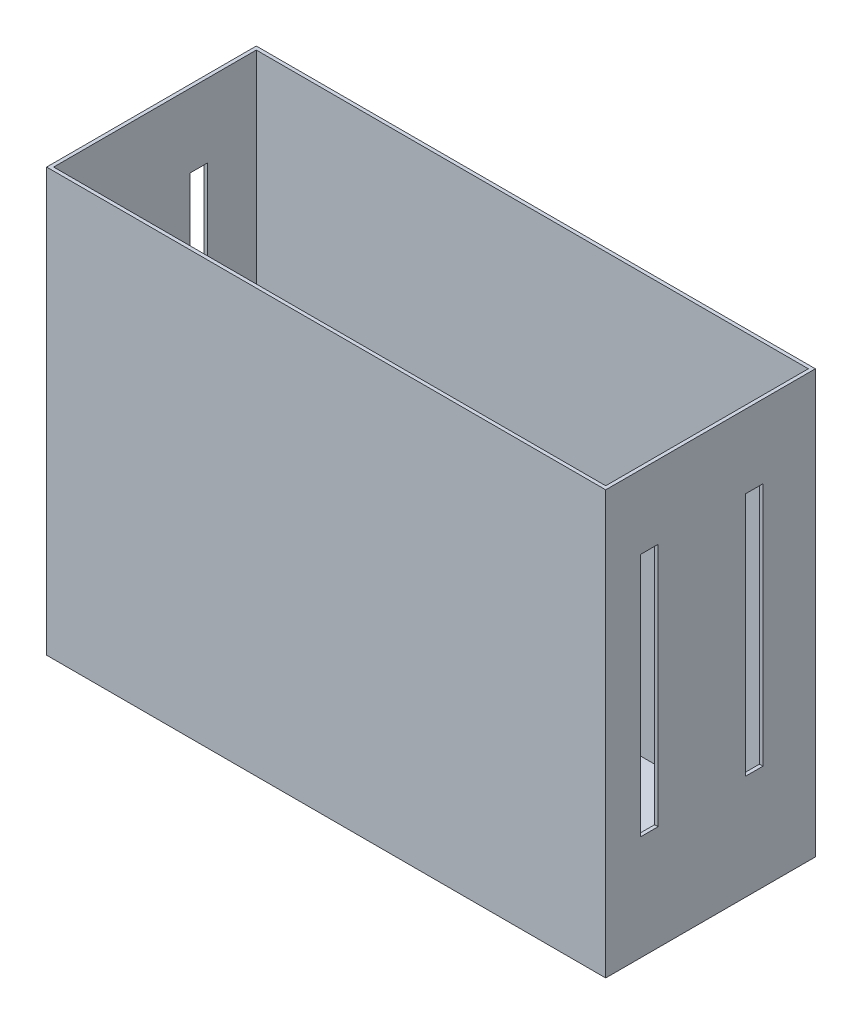
ISO-10303-21;
HEADER;
FILE_DESCRIPTION(('STEP AP214'),'2;1');
FILE_NAME('part.step','',(''),(''),'','','');
FILE_SCHEMA(('AUTOMOTIVE_DESIGN { 1 0 10303 214 1 1 1 1 }'));
ENDSEC;
DATA;
#1=APPLICATION_CONTEXT('core data for automotive mechanical design processes');
#2=APPLICATION_PROTOCOL_DEFINITION('international standard','automotive_design',2000,#1);
#3=PRODUCT_CONTEXT('',#1,'mechanical');
#4=PRODUCT('Part','Part','',(#3));
#5=PRODUCT_RELATED_PRODUCT_CATEGORY('part','',(#4));
#6=PRODUCT_DEFINITION_FORMATION('','',#4);
#7=PRODUCT_DEFINITION_CONTEXT('part definition',#1,'design');
#8=PRODUCT_DEFINITION('design','',#6,#7);
#9=PRODUCT_DEFINITION_SHAPE('','',#8);
#10=(LENGTH_UNIT() NAMED_UNIT(*) SI_UNIT(.MILLI.,.METRE.));
#11=(NAMED_UNIT(*) PLANE_ANGLE_UNIT() SI_UNIT($,.RADIAN.));
#12=(NAMED_UNIT(*) SI_UNIT($,.STERADIAN.) SOLID_ANGLE_UNIT());
#13=UNCERTAINTY_MEASURE_WITH_UNIT(LENGTH_MEASURE(1.E-05),#10,'distance_accuracy_value','');
#14=(GEOMETRIC_REPRESENTATION_CONTEXT(3) GLOBAL_UNCERTAINTY_ASSIGNED_CONTEXT((#13)) GLOBAL_UNIT_ASSIGNED_CONTEXT((#10,
#11,#12)) REPRESENTATION_CONTEXT('',''));
#15=CARTESIAN_POINT('',(0.,0.,0.));
#16=DIRECTION('',(0.,0.,1.));
#17=DIRECTION('',(1.,0.,0.));
#18=AXIS2_PLACEMENT_3D('',#15,#16,#17);
#19=CARTESIAN_POINT('',(0.,304.8,0.));
#20=DIRECTION('',(0.,1.,0.));
#21=DIRECTION('',(0.,0.,1.));
#22=AXIS2_PLACEMENT_3D('',#19,#20,#21);
#23=PLANE('',#22);
#24=DIRECTION('',(0.,0.,1.));
#25=VECTOR('',#24,1.);
#26=CARTESIAN_POINT('',(-203.2,304.8,-76.2));
#27=LINE('',#26,#25);
#28=CARTESIAN_POINT('',(-203.2,304.8,-76.2));
#29=VERTEX_POINT('',#28);
#30=CARTESIAN_POINT('',(-203.2,304.8,76.2));
#31=VERTEX_POINT('',#30);
#32=EDGE_CURVE('E350',#29,#31,#27,.T.);
#33=ORIENTED_EDGE('',*,*,#32,.T.);
#34=DIRECTION('',(1.,0.,0.));
#35=VECTOR('',#34,1.);
#36=CARTESIAN_POINT('',(-203.2,304.8,76.2));
#37=LINE('',#36,#35);
#38=CARTESIAN_POINT('',(203.2,304.8,76.2));
#39=VERTEX_POINT('',#38);
#40=EDGE_CURVE('E353',#31,#39,#37,.T.);
#41=ORIENTED_EDGE('',*,*,#40,.T.);
#42=DIRECTION('',(0.,0.,-1.));
#43=VECTOR('',#42,1.);
#44=CARTESIAN_POINT('',(203.2,304.8,-76.2));
#45=LINE('',#44,#43);
#46=CARTESIAN_POINT('',(203.2,304.8,-76.2));
#47=VERTEX_POINT('',#46);
#48=EDGE_CURVE('E355',#39,#47,#45,.T.);
#49=ORIENTED_EDGE('',*,*,#48,.T.);
#50=DIRECTION('',(-1.,0.,0.));
#51=VECTOR('',#50,1.);
#52=CARTESIAN_POINT('',(-203.2,304.8,-76.2));
#53=LINE('',#52,#51);
#54=EDGE_CURVE('E357',#47,#29,#53,.T.);
#55=ORIENTED_EDGE('',*,*,#54,.T.);
#56=EDGE_LOOP('',(#33,#41,#49,#55));
#57=FACE_BOUND('',#56,.T.);
#58=DIRECTION('',(1.,0.,0.));
#59=VECTOR('',#58,1.);
#60=CARTESIAN_POINT('',(-200.66,304.8,73.66));
#61=LINE('',#60,#59);
#62=CARTESIAN_POINT('',(-200.66,304.8,73.66));
#63=VERTEX_POINT('',#62);
#64=CARTESIAN_POINT('',(200.66,304.8,73.66));
#65=VERTEX_POINT('',#64);
#66=EDGE_CURVE('E323',#63,#65,#61,.T.);
#67=ORIENTED_EDGE('',*,*,#66,.F.);
#68=DIRECTION('',(0.,0.,1.));
#69=VECTOR('',#68,1.);
#70=CARTESIAN_POINT('',(-200.66,304.8,-73.66));
#71=LINE('',#70,#69);
#72=CARTESIAN_POINT('',(-200.66,304.8,-73.66));
#73=VERTEX_POINT('',#72);
#74=EDGE_CURVE('E321',#73,#63,#71,.T.);
#75=ORIENTED_EDGE('',*,*,#74,.F.);
#76=DIRECTION('',(-1.,0.,0.));
#77=VECTOR('',#76,1.);
#78=CARTESIAN_POINT('',(-200.66,304.8,-73.66));
#79=LINE('',#78,#77);
#80=CARTESIAN_POINT('',(200.66,304.8,-73.66));
#81=VERTEX_POINT('',#80);
#82=EDGE_CURVE('E329',#81,#73,#79,.T.);
#83=ORIENTED_EDGE('',*,*,#82,.F.);
#84=DIRECTION('',(0.,0.,-1.));
#85=VECTOR('',#84,1.);
#86=CARTESIAN_POINT('',(200.66,304.8,-73.66));
#87=LINE('',#86,#85);
#88=EDGE_CURVE('E326',#65,#81,#87,.T.);
#89=ORIENTED_EDGE('',*,*,#88,.F.);
#90=EDGE_LOOP('',(#67,#75,#83,#89));
#91=FACE_BOUND('',#90,.T.);
#92=ADVANCED_FACE('F42',(#57,#91),#23,.T.);
#93=CARTESIAN_POINT('',(-203.2,304.8,-76.2));
#94=DIRECTION('',(1.,0.,0.));
#95=DIRECTION('',(0.,0.,-1.));
#96=AXIS2_PLACEMENT_3D('',#93,#94,#95);
#97=PLANE('',#96);
#98=DIRECTION('',(0.,0.,-1.));
#99=VECTOR('',#98,1.);
#100=CARTESIAN_POINT('',(-203.2,73.66,-76.2));
#101=LINE('',#100,#99);
#102=CARTESIAN_POINT('',(-203.2,73.66,50.8));
#103=VERTEX_POINT('',#102);
#104=CARTESIAN_POINT('',(-203.2,73.66,38.1));
#105=VERTEX_POINT('',#104);
#106=EDGE_CURVE('E289',#103,#105,#101,.T.);
#107=ORIENTED_EDGE('',*,*,#106,.T.);
#108=DIRECTION('',(0.,1.,0.));
#109=VECTOR('',#108,1.);
#110=CARTESIAN_POINT('',(-203.2,304.8,38.1));
#111=LINE('',#110,#109);
#112=CARTESIAN_POINT('',(-203.2,251.46,38.1));
#113=VERTEX_POINT('',#112);
#114=EDGE_CURVE('E305',#105,#113,#111,.T.);
#115=ORIENTED_EDGE('',*,*,#114,.T.);
#116=DIRECTION('',(0.,0.,1.));
#117=VECTOR('',#116,1.);
#118=CARTESIAN_POINT('',(-203.2,251.46,-76.2));
#119=LINE('',#118,#117);
#120=CARTESIAN_POINT('',(-203.2,251.46,50.8));
#121=VERTEX_POINT('',#120);
#122=EDGE_CURVE('E300',#113,#121,#119,.T.);
#123=ORIENTED_EDGE('',*,*,#122,.T.);
#124=DIRECTION('',(0.,-1.,0.));
#125=VECTOR('',#124,1.);
#126=CARTESIAN_POINT('',(-203.2,304.8,50.8));
#127=LINE('',#126,#125);
#128=EDGE_CURVE('E295',#121,#103,#127,.T.);
#129=ORIENTED_EDGE('',*,*,#128,.T.);
#130=EDGE_LOOP('',(#107,#115,#123,#129));
#131=FACE_BOUND('',#130,.T.);
#132=DIRECTION('',(0.,0.,-1.));
#133=VECTOR('',#132,1.);
#134=CARTESIAN_POINT('',(-203.2,73.6600000000001,-76.2000000000003));
#135=LINE('',#134,#133);
#136=CARTESIAN_POINT('',(-203.2,73.66,-25.4));
#137=VERTEX_POINT('',#136);
#138=CARTESIAN_POINT('',(-203.2,73.66,-38.1));
#139=VERTEX_POINT('',#138);
#140=EDGE_CURVE('E268',#137,#139,#135,.T.);
#141=ORIENTED_EDGE('',*,*,#140,.T.);
#142=DIRECTION('',(0.,1.,0.));
#143=VECTOR('',#142,1.);
#144=CARTESIAN_POINT('',(-203.2,304.8,-38.1));
#145=LINE('',#144,#143);
#146=CARTESIAN_POINT('',(-203.2,251.46,-38.1));
#147=VERTEX_POINT('',#146);
#148=EDGE_CURVE('E284',#139,#147,#145,.T.);
#149=ORIENTED_EDGE('',*,*,#148,.T.);
#150=DIRECTION('',(0.,0.,1.));
#151=VECTOR('',#150,1.);
#152=CARTESIAN_POINT('',(-203.2,251.46,-76.2));
#153=LINE('',#152,#151);
#154=CARTESIAN_POINT('',(-203.2,251.46,-25.4));
#155=VERTEX_POINT('',#154);
#156=EDGE_CURVE('E279',#147,#155,#153,.T.);
#157=ORIENTED_EDGE('',*,*,#156,.T.);
#158=DIRECTION('',(0.,-1.,0.));
#159=VECTOR('',#158,1.);
#160=CARTESIAN_POINT('',(-203.2,304.8,-25.4));
#161=LINE('',#160,#159);
#162=EDGE_CURVE('E274',#155,#137,#161,.T.);
#163=ORIENTED_EDGE('',*,*,#162,.T.);
#164=EDGE_LOOP('',(#141,#149,#157,#163));
#165=FACE_BOUND('',#164,.T.);
#166=DIRECTION('',(0.,-1.,0.));
#167=VECTOR('',#166,1.);
#168=CARTESIAN_POINT('',(-203.2,304.8,-76.2));
#169=LINE('',#168,#167);
#170=CARTESIAN_POINT('',(-203.2,-2.54,-76.2));
#171=VERTEX_POINT('',#170);
#172=EDGE_CURVE('E359',#29,#171,#169,.T.);
#173=ORIENTED_EDGE('',*,*,#172,.T.);
#174=DIRECTION('',(0.,0.,-1.));
#175=VECTOR('',#174,1.);
#176=CARTESIAN_POINT('',(-203.2,-2.54,-76.2));
#177=LINE('',#176,#175);
#178=CARTESIAN_POINT('',(-203.2,-2.54,76.2));
#179=VERTEX_POINT('',#178);
#180=EDGE_CURVE('E311',#179,#171,#177,.T.);
#181=ORIENTED_EDGE('',*,*,#180,.F.);
#182=DIRECTION('',(0.,-1.,0.));
#183=VECTOR('',#182,1.);
#184=CARTESIAN_POINT('',(-203.2,304.8,76.2));
#185=LINE('',#184,#183);
#186=EDGE_CURVE('E365',#31,#179,#185,.T.);
#187=ORIENTED_EDGE('',*,*,#186,.F.);
#188=ORIENTED_EDGE('',*,*,#32,.F.);
#189=EDGE_LOOP('',(#173,#181,#187,#188));
#190=FACE_BOUND('',#189,.T.);
#191=ADVANCED_FACE('F44',(#131,#165,#190),#97,.F.);
#192=CARTESIAN_POINT('',(-203.2,304.8,76.2));
#193=DIRECTION('',(0.,0.,-1.));
#194=DIRECTION('',(-1.,0.,0.));
#195=AXIS2_PLACEMENT_3D('',#192,#193,#194);
#196=PLANE('',#195);
#197=ORIENTED_EDGE('',*,*,#186,.T.);
#198=DIRECTION('',(-1.,0.,0.));
#199=VECTOR('',#198,1.);
#200=CARTESIAN_POINT('',(-203.2,-2.54,76.2));
#201=LINE('',#200,#199);
#202=CARTESIAN_POINT('',(203.2,-2.54,76.2));
#203=VERTEX_POINT('',#202);
#204=EDGE_CURVE('E308',#203,#179,#201,.T.);
#205=ORIENTED_EDGE('',*,*,#204,.F.);
#206=DIRECTION('',(0.,-1.,0.));
#207=VECTOR('',#206,1.);
#208=CARTESIAN_POINT('',(203.2,304.8,76.2));
#209=LINE('',#208,#207);
#210=EDGE_CURVE('E363',#39,#203,#209,.T.);
#211=ORIENTED_EDGE('',*,*,#210,.F.);
#212=ORIENTED_EDGE('',*,*,#40,.F.);
#213=EDGE_LOOP('',(#197,#205,#211,#212));
#214=FACE_BOUND('',#213,.T.);
#215=ADVANCED_FACE('F408',(#214),#196,.F.);
#216=CARTESIAN_POINT('',(203.2,304.8,-76.2));
#217=DIRECTION('',(-1.,0.,0.));
#218=DIRECTION('',(0.,0.,1.));
#219=AXIS2_PLACEMENT_3D('',#216,#217,#218);
#220=PLANE('',#219);
#221=DIRECTION('',(0.,0.,-1.));
#222=VECTOR('',#221,1.);
#223=CARTESIAN_POINT('',(203.2,251.46,38.1));
#224=LINE('',#223,#222);
#225=CARTESIAN_POINT('',(203.2,251.46,50.8));
#226=VERTEX_POINT('',#225);
#227=CARTESIAN_POINT('',(203.2,251.46,38.1));
#228=VERTEX_POINT('',#227);
#229=EDGE_CURVE('E227',#226,#228,#224,.T.);
#230=ORIENTED_EDGE('',*,*,#229,.T.);
#231=DIRECTION('',(0.,-1.,0.));
#232=VECTOR('',#231,1.);
#233=CARTESIAN_POINT('',(203.2,251.46,38.1));
#234=LINE('',#233,#232);
#235=CARTESIAN_POINT('',(203.2,73.66,38.1));
#236=VERTEX_POINT('',#235);
#237=EDGE_CURVE('E207',#228,#236,#234,.T.);
#238=ORIENTED_EDGE('',*,*,#237,.T.);
#239=DIRECTION('',(0.,0.,1.));
#240=VECTOR('',#239,1.);
#241=CARTESIAN_POINT('',(203.2,73.66,38.1));
#242=LINE('',#241,#240);
#243=CARTESIAN_POINT('',(203.2,73.66,50.8));
#244=VERTEX_POINT('',#243);
#245=EDGE_CURVE('E216',#236,#244,#242,.T.);
#246=ORIENTED_EDGE('',*,*,#245,.T.);
#247=DIRECTION('',(0.,1.,0.));
#248=VECTOR('',#247,1.);
#249=CARTESIAN_POINT('',(203.2,251.46,50.8));
#250=LINE('',#249,#248);
#251=EDGE_CURVE('E222',#244,#226,#250,.T.);
#252=ORIENTED_EDGE('',*,*,#251,.T.);
#253=EDGE_LOOP('',(#230,#238,#246,#252));
#254=FACE_BOUND('',#253,.T.);
#255=DIRECTION('',(0.,0.,-1.));
#256=VECTOR('',#255,1.);
#257=CARTESIAN_POINT('',(203.2,251.46,-25.4));
#258=LINE('',#257,#256);
#259=CARTESIAN_POINT('',(203.2,251.46,-25.4));
#260=VERTEX_POINT('',#259);
#261=CARTESIAN_POINT('',(203.2,251.46,-38.1));
#262=VERTEX_POINT('',#261);
#263=EDGE_CURVE('E247',#260,#262,#258,.T.);
#264=ORIENTED_EDGE('',*,*,#263,.T.);
#265=DIRECTION('',(0.,-1.,0.));
#266=VECTOR('',#265,1.);
#267=CARTESIAN_POINT('',(203.2,73.66,-38.1));
#268=LINE('',#267,#266);
#269=CARTESIAN_POINT('',(203.2,73.66,-38.1));
#270=VERTEX_POINT('',#269);
#271=EDGE_CURVE('E228',#262,#270,#268,.T.);
#272=ORIENTED_EDGE('',*,*,#271,.T.);
#273=DIRECTION('',(0.,0.,1.));
#274=VECTOR('',#273,1.);
#275=CARTESIAN_POINT('',(203.2,73.66,-25.4));
#276=LINE('',#275,#274);
#277=CARTESIAN_POINT('',(203.2,73.66,-25.4));
#278=VERTEX_POINT('',#277);
#279=EDGE_CURVE('E231',#270,#278,#276,.T.);
#280=ORIENTED_EDGE('',*,*,#279,.T.);
#281=DIRECTION('',(0.,1.,0.));
#282=VECTOR('',#281,1.);
#283=CARTESIAN_POINT('',(203.2,73.66,-25.4));
#284=LINE('',#283,#282);
#285=EDGE_CURVE('E262',#278,#260,#284,.T.);
#286=ORIENTED_EDGE('',*,*,#285,.T.);
#287=EDGE_LOOP('',(#264,#272,#280,#286));
#288=FACE_BOUND('',#287,.T.);
#289=ORIENTED_EDGE('',*,*,#210,.T.);
#290=DIRECTION('',(0.,0.,1.));
#291=VECTOR('',#290,1.);
#292=CARTESIAN_POINT('',(203.2,-2.54,76.2));
#293=LINE('',#292,#291);
#294=CARTESIAN_POINT('',(203.2,-2.54,-76.2));
#295=VERTEX_POINT('',#294);
#296=EDGE_CURVE('E317',#295,#203,#293,.T.);
#297=ORIENTED_EDGE('',*,*,#296,.F.);
#298=DIRECTION('',(0.,-1.,0.));
#299=VECTOR('',#298,1.);
#300=CARTESIAN_POINT('',(203.2,304.8,-76.2));
#301=LINE('',#300,#299);
#302=EDGE_CURVE('E361',#47,#295,#301,.T.);
#303=ORIENTED_EDGE('',*,*,#302,.F.);
#304=ORIENTED_EDGE('',*,*,#48,.F.);
#305=EDGE_LOOP('',(#289,#297,#303,#304));
#306=FACE_BOUND('',#305,.T.);
#307=ADVANCED_FACE('F224',(#254,#288,#306),#220,.F.);
#308=CARTESIAN_POINT('',(-203.2,304.8,-76.2));
#309=DIRECTION('',(0.,0.,1.));
#310=DIRECTION('',(1.,0.,0.));
#311=AXIS2_PLACEMENT_3D('',#308,#309,#310);
#312=PLANE('',#311);
#313=ORIENTED_EDGE('',*,*,#302,.T.);
#314=DIRECTION('',(1.,0.,0.));
#315=VECTOR('',#314,1.);
#316=CARTESIAN_POINT('',(203.2,-2.54,-76.2));
#317=LINE('',#316,#315);
#318=EDGE_CURVE('E314',#171,#295,#317,.T.);
#319=ORIENTED_EDGE('',*,*,#318,.F.);
#320=ORIENTED_EDGE('',*,*,#172,.F.);
#321=ORIENTED_EDGE('',*,*,#54,.F.);
#322=EDGE_LOOP('',(#313,#319,#320,#321));
#323=FACE_BOUND('',#322,.T.);
#324=ADVANCED_FACE('F415',(#323),#312,.F.);
#325=CARTESIAN_POINT('',(-200.66,304.8,-73.66));
#326=DIRECTION('',(1.,0.,0.));
#327=DIRECTION('',(0.,0.,-1.));
#328=AXIS2_PLACEMENT_3D('',#325,#326,#327);
#329=PLANE('',#328);
#330=DIRECTION('',(0.,1.,0.));
#331=VECTOR('',#330,1.);
#332=CARTESIAN_POINT('',(-200.66,304.8,38.1));
#333=LINE('',#332,#331);
#334=CARTESIAN_POINT('',(-200.66,73.66,38.1));
#335=VERTEX_POINT('',#334);
#336=CARTESIAN_POINT('',(-200.66,251.46,38.1));
#337=VERTEX_POINT('',#336);
#338=EDGE_CURVE('E303',#335,#337,#333,.T.);
#339=ORIENTED_EDGE('',*,*,#338,.F.);
#340=DIRECTION('',(0.,0.,-1.));
#341=VECTOR('',#340,1.);
#342=CARTESIAN_POINT('',(-200.66,73.66,-73.66));
#343=LINE('',#342,#341);
#344=CARTESIAN_POINT('',(-200.66,73.66,50.8));
#345=VERTEX_POINT('',#344);
#346=EDGE_CURVE('E287',#345,#335,#343,.T.);
#347=ORIENTED_EDGE('',*,*,#346,.F.);
#348=DIRECTION('',(0.,-1.,0.));
#349=VECTOR('',#348,1.);
#350=CARTESIAN_POINT('',(-200.66,304.8,50.8));
#351=LINE('',#350,#349);
#352=CARTESIAN_POINT('',(-200.66,251.46,50.8));
#353=VERTEX_POINT('',#352);
#354=EDGE_CURVE('E292',#353,#345,#351,.T.);
#355=ORIENTED_EDGE('',*,*,#354,.F.);
#356=DIRECTION('',(0.,0.,1.));
#357=VECTOR('',#356,1.);
#358=CARTESIAN_POINT('',(-200.66,251.46,-73.66));
#359=LINE('',#358,#357);
#360=EDGE_CURVE('E298',#337,#353,#359,.T.);
#361=ORIENTED_EDGE('',*,*,#360,.F.);
#362=EDGE_LOOP('',(#339,#347,#355,#361));
#363=FACE_BOUND('',#362,.T.);
#364=DIRECTION('',(0.,1.,0.));
#365=VECTOR('',#364,1.);
#366=CARTESIAN_POINT('',(-200.66,304.8,-38.1));
#367=LINE('',#366,#365);
#368=CARTESIAN_POINT('',(-200.66,73.66,-38.1));
#369=VERTEX_POINT('',#368);
#370=CARTESIAN_POINT('',(-200.66,251.46,-38.1));
#371=VERTEX_POINT('',#370);
#372=EDGE_CURVE('E282',#369,#371,#367,.T.);
#373=ORIENTED_EDGE('',*,*,#372,.F.);
#374=DIRECTION('',(0.,0.,-1.));
#375=VECTOR('',#374,1.);
#376=CARTESIAN_POINT('',(-200.66,73.6600000000001,-73.6600000000003));
#377=LINE('',#376,#375);
#378=CARTESIAN_POINT('',(-200.66,73.66,-25.4));
#379=VERTEX_POINT('',#378);
#380=EDGE_CURVE('E238',#379,#369,#377,.T.);
#381=ORIENTED_EDGE('',*,*,#380,.F.);
#382=DIRECTION('',(0.,-1.,0.));
#383=VECTOR('',#382,1.);
#384=CARTESIAN_POINT('',(-200.66,304.8,-25.4));
#385=LINE('',#384,#383);
#386=CARTESIAN_POINT('',(-200.66,251.46,-25.4));
#387=VERTEX_POINT('',#386);
#388=EDGE_CURVE('E271',#387,#379,#385,.T.);
#389=ORIENTED_EDGE('',*,*,#388,.F.);
#390=DIRECTION('',(0.,0.,1.));
#391=VECTOR('',#390,1.);
#392=CARTESIAN_POINT('',(-200.66,251.46,-73.66));
#393=LINE('',#392,#391);
#394=EDGE_CURVE('E277',#371,#387,#393,.T.);
#395=ORIENTED_EDGE('',*,*,#394,.F.);
#396=EDGE_LOOP('',(#373,#381,#389,#395));
#397=FACE_BOUND('',#396,.T.);
#398=DIRECTION('',(0.,0.,1.));
#399=VECTOR('',#398,1.);
#400=CARTESIAN_POINT('',(-200.66,0.,-73.66));
#401=LINE('',#400,#399);
#402=CARTESIAN_POINT('',(-200.66,0.,-73.66));
#403=VERTEX_POINT('',#402);
#404=CARTESIAN_POINT('',(-200.66,0.,73.66));
#405=VERTEX_POINT('',#404);
#406=EDGE_CURVE('E320',#403,#405,#401,.T.);
#407=ORIENTED_EDGE('',*,*,#406,.F.);
#408=DIRECTION('',(0.,-1.,0.));
#409=VECTOR('',#408,1.);
#410=CARTESIAN_POINT('',(-200.66,304.8,-73.66));
#411=LINE('',#410,#409);
#412=EDGE_CURVE('E331',#73,#403,#411,.T.);
#413=ORIENTED_EDGE('',*,*,#412,.F.);
#414=ORIENTED_EDGE('',*,*,#74,.T.);
#415=DIRECTION('',(0.,-1.,0.));
#416=VECTOR('',#415,1.);
#417=CARTESIAN_POINT('',(-200.66,304.8,73.66));
#418=LINE('',#417,#416);
#419=EDGE_CURVE('E347',#63,#405,#418,.T.);
#420=ORIENTED_EDGE('',*,*,#419,.T.);
#421=EDGE_LOOP('',(#407,#413,#414,#420));
#422=FACE_BOUND('',#421,.T.);
#423=ADVANCED_FACE('F413',(#363,#397,#422),#329,.T.);
#424=CARTESIAN_POINT('',(-200.66,304.8,73.66));
#425=DIRECTION('',(0.,0.,-1.));
#426=DIRECTION('',(-1.,0.,0.));
#427=AXIS2_PLACEMENT_3D('',#424,#425,#426);
#428=PLANE('',#427);
#429=DIRECTION('',(1.,0.,0.));
#430=VECTOR('',#429,1.);
#431=CARTESIAN_POINT('',(-200.66,0.,73.66));
#432=LINE('',#431,#430);
#433=CARTESIAN_POINT('',(200.66,0.,73.66));
#434=VERTEX_POINT('',#433);
#435=EDGE_CURVE('E334',#405,#434,#432,.T.);
#436=ORIENTED_EDGE('',*,*,#435,.F.);
#437=ORIENTED_EDGE('',*,*,#419,.F.);
#438=ORIENTED_EDGE('',*,*,#66,.T.);
#439=DIRECTION('',(0.,-1.,0.));
#440=VECTOR('',#439,1.);
#441=CARTESIAN_POINT('',(200.66,304.8,73.66));
#442=LINE('',#441,#440);
#443=EDGE_CURVE('E345',#65,#434,#442,.T.);
#444=ORIENTED_EDGE('',*,*,#443,.T.);
#445=EDGE_LOOP('',(#436,#437,#438,#444));
#446=FACE_BOUND('',#445,.T.);
#447=ADVANCED_FACE('F462',(#446),#428,.T.);
#448=CARTESIAN_POINT('',(200.66,304.8,-73.66));
#449=DIRECTION('',(-1.,0.,0.));
#450=DIRECTION('',(0.,0.,1.));
#451=AXIS2_PLACEMENT_3D('',#448,#449,#450);
#452=PLANE('',#451);
#453=DIRECTION('',(0.,-1.,0.));
#454=VECTOR('',#453,1.);
#455=CARTESIAN_POINT('',(200.66,304.8,38.1));
#456=LINE('',#455,#454);
#457=CARTESIAN_POINT('',(200.66,251.46,38.1));
#458=VERTEX_POINT('',#457);
#459=CARTESIAN_POINT('',(200.66,73.66,38.1));
#460=VERTEX_POINT('',#459);
#461=EDGE_CURVE('E11',#458,#460,#456,.T.);
#462=ORIENTED_EDGE('',*,*,#461,.F.);
#463=DIRECTION('',(0.,0.,-1.));
#464=VECTOR('',#463,1.);
#465=CARTESIAN_POINT('',(200.66,251.46,-73.66));
#466=LINE('',#465,#464);
#467=CARTESIAN_POINT('',(200.66,251.46,50.8));
#468=VERTEX_POINT('',#467);
#469=EDGE_CURVE('E50',#468,#458,#466,.T.);
#470=ORIENTED_EDGE('',*,*,#469,.F.);
#471=DIRECTION('',(0.,1.,0.));
#472=VECTOR('',#471,1.);
#473=CARTESIAN_POINT('',(200.66,304.8,50.8));
#474=LINE('',#473,#472);
#475=CARTESIAN_POINT('',(200.66,73.66,50.8));
#476=VERTEX_POINT('',#475);
#477=EDGE_CURVE('E378',#476,#468,#474,.T.);
#478=ORIENTED_EDGE('',*,*,#477,.F.);
#479=DIRECTION('',(0.,0.,1.));
#480=VECTOR('',#479,1.);
#481=CARTESIAN_POINT('',(200.66,73.66,-73.66));
#482=LINE('',#481,#480);
#483=EDGE_CURVE('E376',#460,#476,#482,.T.);
#484=ORIENTED_EDGE('',*,*,#483,.F.);
#485=EDGE_LOOP('',(#462,#470,#478,#484));
#486=FACE_BOUND('',#485,.T.);
#487=DIRECTION('',(0.,-1.,0.));
#488=VECTOR('',#487,1.);
#489=CARTESIAN_POINT('',(200.66,304.8,-38.1));
#490=LINE('',#489,#488);
#491=CARTESIAN_POINT('',(200.66,251.46,-38.1));
#492=VERTEX_POINT('',#491);
#493=CARTESIAN_POINT('',(200.66,73.66,-38.1));
#494=VERTEX_POINT('',#493);
#495=EDGE_CURVE('E373',#492,#494,#490,.T.);
#496=ORIENTED_EDGE('',*,*,#495,.F.);
#497=DIRECTION('',(0.,0.,-1.));
#498=VECTOR('',#497,1.);
#499=CARTESIAN_POINT('',(200.66,251.46,-73.66));
#500=LINE('',#499,#498);
#501=CARTESIAN_POINT('',(200.66,251.46,-25.4));
#502=VERTEX_POINT('',#501);
#503=EDGE_CURVE('E371',#502,#492,#500,.T.);
#504=ORIENTED_EDGE('',*,*,#503,.F.);
#505=DIRECTION('',(0.,1.,0.));
#506=VECTOR('',#505,1.);
#507=CARTESIAN_POINT('',(200.66,304.8,-25.4));
#508=LINE('',#507,#506);
#509=CARTESIAN_POINT('',(200.66,73.66,-25.4));
#510=VERTEX_POINT('',#509);
#511=EDGE_CURVE('E369',#510,#502,#508,.T.);
#512=ORIENTED_EDGE('',*,*,#511,.F.);
#513=DIRECTION('',(0.,0.,1.));
#514=VECTOR('',#513,1.);
#515=CARTESIAN_POINT('',(200.66,73.6600000000001,-73.6600000000003));
#516=LINE('',#515,#514);
#517=EDGE_CURVE('E367',#494,#510,#516,.T.);
#518=ORIENTED_EDGE('',*,*,#517,.F.);
#519=EDGE_LOOP('',(#496,#504,#512,#518));
#520=FACE_BOUND('',#519,.T.);
#521=DIRECTION('',(0.,0.,-1.));
#522=VECTOR('',#521,1.);
#523=CARTESIAN_POINT('',(200.66,0.,-73.66));
#524=LINE('',#523,#522);
#525=CARTESIAN_POINT('',(200.66,0.,-73.66));
#526=VERTEX_POINT('',#525);
#527=EDGE_CURVE('E337',#434,#526,#524,.T.);
#528=ORIENTED_EDGE('',*,*,#527,.F.);
#529=ORIENTED_EDGE('',*,*,#443,.F.);
#530=ORIENTED_EDGE('',*,*,#88,.T.);
#531=DIRECTION('',(0.,-1.,0.));
#532=VECTOR('',#531,1.);
#533=CARTESIAN_POINT('',(200.66,304.8,-73.66));
#534=LINE('',#533,#532);
#535=EDGE_CURVE('E343',#81,#526,#534,.T.);
#536=ORIENTED_EDGE('',*,*,#535,.T.);
#537=EDGE_LOOP('',(#528,#529,#530,#536));
#538=FACE_BOUND('',#537,.T.);
#539=ADVANCED_FACE('F384',(#486,#520,#538),#452,.T.);
#540=CARTESIAN_POINT('',(-200.66,304.8,-73.66));
#541=DIRECTION('',(0.,0.,1.));
#542=DIRECTION('',(1.,0.,0.));
#543=AXIS2_PLACEMENT_3D('',#540,#541,#542);
#544=PLANE('',#543);
#545=DIRECTION('',(-1.,0.,0.));
#546=VECTOR('',#545,1.);
#547=CARTESIAN_POINT('',(-200.66,0.,-73.66));
#548=LINE('',#547,#546);
#549=EDGE_CURVE('E324',#526,#403,#548,.T.);
#550=ORIENTED_EDGE('',*,*,#549,.F.);
#551=ORIENTED_EDGE('',*,*,#535,.F.);
#552=ORIENTED_EDGE('',*,*,#82,.T.);
#553=ORIENTED_EDGE('',*,*,#412,.T.);
#554=EDGE_LOOP('',(#550,#551,#552,#553));
#555=FACE_BOUND('',#554,.T.);
#556=ADVANCED_FACE('F451',(#555),#544,.T.);
#557=CARTESIAN_POINT('',(0.,0.,0.));
#558=DIRECTION('',(0.,1.,0.));
#559=DIRECTION('',(0.,0.,1.));
#560=AXIS2_PLACEMENT_3D('',#557,#558,#559);
#561=PLANE('',#560);
#562=ORIENTED_EDGE('',*,*,#549,.T.);
#563=ORIENTED_EDGE('',*,*,#406,.T.);
#564=ORIENTED_EDGE('',*,*,#435,.T.);
#565=ORIENTED_EDGE('',*,*,#527,.T.);
#566=EDGE_LOOP('',(#562,#563,#564,#565));
#567=FACE_BOUND('',#566,.T.);
#568=ADVANCED_FACE('F441',(#567),#561,.T.);
#569=CARTESIAN_POINT('',(0.,-2.54,0.));
#570=DIRECTION('',(0.,1.,0.));
#571=DIRECTION('',(0.,0.,1.));
#572=AXIS2_PLACEMENT_3D('',#569,#570,#571);
#573=PLANE('',#572);
#574=ORIENTED_EDGE('',*,*,#204,.T.);
#575=ORIENTED_EDGE('',*,*,#180,.T.);
#576=ORIENTED_EDGE('',*,*,#318,.T.);
#577=ORIENTED_EDGE('',*,*,#296,.T.);
#578=EDGE_LOOP('',(#574,#575,#576,#577));
#579=FACE_BOUND('',#578,.T.);
#580=ADVANCED_FACE('F433',(#579),#573,.F.);
#581=CARTESIAN_POINT('',(203.2,73.66,-25.4));
#582=DIRECTION('',(0.,-1.,0.));
#583=DIRECTION('',(0.,0.,-1.));
#584=AXIS2_PLACEMENT_3D('',#581,#582,#583);
#585=PLANE('',#584);
#586=ORIENTED_EDGE('',*,*,#517,.T.);
#587=DIRECTION('',(-1.,0.,0.));
#588=VECTOR('',#587,1.);
#589=CARTESIAN_POINT('',(203.2,73.66,-25.4));
#590=LINE('',#589,#588);
#591=EDGE_CURVE('E248',#278,#510,#590,.T.);
#592=ORIENTED_EDGE('',*,*,#591,.F.);
#593=ORIENTED_EDGE('',*,*,#279,.F.);
#594=DIRECTION('',(-1.,0.,0.));
#595=VECTOR('',#594,1.);
#596=CARTESIAN_POINT('',(203.2,73.66,-38.1));
#597=LINE('',#596,#595);
#598=EDGE_CURVE('E245',#270,#494,#597,.T.);
#599=ORIENTED_EDGE('',*,*,#598,.T.);
#600=EDGE_LOOP('',(#586,#592,#593,#599));
#601=FACE_BOUND('',#600,.T.);
#602=ADVANCED_FACE('F440',(#601),#585,.F.);
#603=CARTESIAN_POINT('',(203.2,73.66,-25.4));
#604=DIRECTION('',(0.,0.,1.));
#605=DIRECTION('',(0.,-1.,0.));
#606=AXIS2_PLACEMENT_3D('',#603,#604,#605);
#607=PLANE('',#606);
#608=ORIENTED_EDGE('',*,*,#511,.T.);
#609=DIRECTION('',(-1.,0.,0.));
#610=VECTOR('',#609,1.);
#611=CARTESIAN_POINT('',(203.2,251.46,-25.4));
#612=LINE('',#611,#610);
#613=EDGE_CURVE('E252',#260,#502,#612,.T.);
#614=ORIENTED_EDGE('',*,*,#613,.F.);
#615=ORIENTED_EDGE('',*,*,#285,.F.);
#616=ORIENTED_EDGE('',*,*,#591,.T.);
#617=EDGE_LOOP('',(#608,#614,#615,#616));
#618=FACE_BOUND('',#617,.T.);
#619=ADVANCED_FACE('F447',(#618),#607,.F.);
#620=CARTESIAN_POINT('',(203.2,251.46,-25.4));
#621=DIRECTION('',(0.,1.,0.));
#622=DIRECTION('',(0.,0.,1.));
#623=AXIS2_PLACEMENT_3D('',#620,#621,#622);
#624=PLANE('',#623);
#625=ORIENTED_EDGE('',*,*,#503,.T.);
#626=DIRECTION('',(-1.,0.,0.));
#627=VECTOR('',#626,1.);
#628=CARTESIAN_POINT('',(203.2,251.46,-38.1));
#629=LINE('',#628,#627);
#630=EDGE_CURVE('E256',#262,#492,#629,.T.);
#631=ORIENTED_EDGE('',*,*,#630,.F.);
#632=ORIENTED_EDGE('',*,*,#263,.F.);
#633=ORIENTED_EDGE('',*,*,#613,.T.);
#634=EDGE_LOOP('',(#625,#631,#632,#633));
#635=FACE_BOUND('',#634,.T.);
#636=ADVANCED_FACE('F455',(#635),#624,.F.);
#637=CARTESIAN_POINT('',(203.2,73.66,-38.1));
#638=DIRECTION('',(0.,0.,-1.));
#639=DIRECTION('',(-1.,0.,0.));
#640=AXIS2_PLACEMENT_3D('',#637,#638,#639);
#641=PLANE('',#640);
#642=ORIENTED_EDGE('',*,*,#495,.T.);
#643=ORIENTED_EDGE('',*,*,#598,.F.);
#644=ORIENTED_EDGE('',*,*,#271,.F.);
#645=ORIENTED_EDGE('',*,*,#630,.T.);
#646=EDGE_LOOP('',(#642,#643,#644,#645));
#647=FACE_BOUND('',#646,.T.);
#648=ADVANCED_FACE('F397',(#647),#641,.F.);
#649=CARTESIAN_POINT('',(203.2,73.66,38.1));
#650=DIRECTION('',(0.,-1.,0.));
#651=DIRECTION('',(0.,0.,-1.));
#652=AXIS2_PLACEMENT_3D('',#649,#650,#651);
#653=PLANE('',#652);
#654=ORIENTED_EDGE('',*,*,#483,.T.);
#655=DIRECTION('',(-1.,0.,0.));
#656=VECTOR('',#655,1.);
#657=CARTESIAN_POINT('',(203.2,73.66,50.8));
#658=LINE('',#657,#656);
#659=EDGE_CURVE('E219',#244,#476,#658,.T.);
#660=ORIENTED_EDGE('',*,*,#659,.F.);
#661=ORIENTED_EDGE('',*,*,#245,.F.);
#662=DIRECTION('',(-1.,0.,0.));
#663=VECTOR('',#662,1.);
#664=CARTESIAN_POINT('',(203.2,73.66,38.1));
#665=LINE('',#664,#663);
#666=EDGE_CURVE('E202',#236,#460,#665,.T.);
#667=ORIENTED_EDGE('',*,*,#666,.T.);
#668=EDGE_LOOP('',(#654,#660,#661,#667));
#669=FACE_BOUND('',#668,.T.);
#670=ADVANCED_FACE('F217',(#669),#653,.F.);
#671=CARTESIAN_POINT('',(203.2,251.46,50.8));
#672=DIRECTION('',(0.,0.,1.));
#673=DIRECTION('',(0.,-1.,0.));
#674=AXIS2_PLACEMENT_3D('',#671,#672,#673);
#675=PLANE('',#674);
#676=ORIENTED_EDGE('',*,*,#477,.T.);
#677=DIRECTION('',(-1.,0.,0.));
#678=VECTOR('',#677,1.);
#679=CARTESIAN_POINT('',(203.2,251.46,50.8));
#680=LINE('',#679,#678);
#681=EDGE_CURVE('E240',#226,#468,#680,.T.);
#682=ORIENTED_EDGE('',*,*,#681,.F.);
#683=ORIENTED_EDGE('',*,*,#251,.F.);
#684=ORIENTED_EDGE('',*,*,#659,.T.);
#685=EDGE_LOOP('',(#676,#682,#683,#684));
#686=FACE_BOUND('',#685,.T.);
#687=ADVANCED_FACE('F387',(#686),#675,.F.);
#688=CARTESIAN_POINT('',(203.2,251.46,38.1));
#689=DIRECTION('',(0.,1.,0.));
#690=DIRECTION('',(0.,0.,1.));
#691=AXIS2_PLACEMENT_3D('',#688,#689,#690);
#692=PLANE('',#691);
#693=ORIENTED_EDGE('',*,*,#469,.T.);
#694=DIRECTION('',(-1.,0.,0.));
#695=VECTOR('',#694,1.);
#696=CARTESIAN_POINT('',(203.2,251.46,38.1));
#697=LINE('',#696,#695);
#698=EDGE_CURVE('E236',#228,#458,#697,.T.);
#699=ORIENTED_EDGE('',*,*,#698,.F.);
#700=ORIENTED_EDGE('',*,*,#229,.F.);
#701=ORIENTED_EDGE('',*,*,#681,.T.);
#702=EDGE_LOOP('',(#693,#699,#700,#701));
#703=FACE_BOUND('',#702,.T.);
#704=ADVANCED_FACE('F381',(#703),#692,.F.);
#705=CARTESIAN_POINT('',(203.2,251.46,38.1));
#706=DIRECTION('',(0.,0.,-1.));
#707=DIRECTION('',(0.,1.,0.));
#708=AXIS2_PLACEMENT_3D('',#705,#706,#707);
#709=PLANE('',#708);
#710=ORIENTED_EDGE('',*,*,#461,.T.);
#711=ORIENTED_EDGE('',*,*,#666,.F.);
#712=ORIENTED_EDGE('',*,*,#237,.F.);
#713=ORIENTED_EDGE('',*,*,#698,.T.);
#714=EDGE_LOOP('',(#710,#711,#712,#713));
#715=FACE_BOUND('',#714,.T.);
#716=ADVANCED_FACE('F204',(#715),#709,.F.);
#717=EDGE_CURVE('E65',#369,#139,#597,.T.);
#718=ORIENTED_EDGE('',*,*,#717,.F.);
#719=ORIENTED_EDGE('',*,*,#372,.T.);
#720=EDGE_CURVE('E259',#371,#147,#629,.T.);
#721=ORIENTED_EDGE('',*,*,#720,.T.);
#722=ORIENTED_EDGE('',*,*,#148,.F.);
#723=EDGE_LOOP('',(#718,#719,#721,#722));
#724=FACE_BOUND('',#723,.T.);
#725=ADVANCED_FACE('F494',(#724),#641,.F.);
#726=ORIENTED_EDGE('',*,*,#720,.F.);
#727=ORIENTED_EDGE('',*,*,#394,.T.);
#728=EDGE_CURVE('E255',#387,#155,#612,.T.);
#729=ORIENTED_EDGE('',*,*,#728,.T.);
#730=ORIENTED_EDGE('',*,*,#156,.F.);
#731=EDGE_LOOP('',(#726,#727,#729,#730));
#732=FACE_BOUND('',#731,.T.);
#733=ADVANCED_FACE('F496',(#732),#624,.F.);
#734=ORIENTED_EDGE('',*,*,#728,.F.);
#735=ORIENTED_EDGE('',*,*,#388,.T.);
#736=EDGE_CURVE('E251',#379,#137,#590,.T.);
#737=ORIENTED_EDGE('',*,*,#736,.T.);
#738=ORIENTED_EDGE('',*,*,#162,.F.);
#739=EDGE_LOOP('',(#734,#735,#737,#738));
#740=FACE_BOUND('',#739,.T.);
#741=ADVANCED_FACE('F502',(#740),#607,.F.);
#742=ORIENTED_EDGE('',*,*,#736,.F.);
#743=ORIENTED_EDGE('',*,*,#380,.T.);
#744=ORIENTED_EDGE('',*,*,#717,.T.);
#745=ORIENTED_EDGE('',*,*,#140,.F.);
#746=EDGE_LOOP('',(#742,#743,#744,#745));
#747=FACE_BOUND('',#746,.T.);
#748=ADVANCED_FACE('F450',(#747),#585,.F.);
#749=EDGE_CURVE('E57',#335,#105,#665,.T.);
#750=ORIENTED_EDGE('',*,*,#749,.F.);
#751=ORIENTED_EDGE('',*,*,#338,.T.);
#752=EDGE_CURVE('E239',#337,#113,#697,.T.);
#753=ORIENTED_EDGE('',*,*,#752,.T.);
#754=ORIENTED_EDGE('',*,*,#114,.F.);
#755=EDGE_LOOP('',(#750,#751,#753,#754));
#756=FACE_BOUND('',#755,.T.);
#757=ADVANCED_FACE('F508',(#756),#709,.F.);
#758=ORIENTED_EDGE('',*,*,#752,.F.);
#759=ORIENTED_EDGE('',*,*,#360,.T.);
#760=EDGE_CURVE('E243',#353,#121,#680,.T.);
#761=ORIENTED_EDGE('',*,*,#760,.T.);
#762=ORIENTED_EDGE('',*,*,#122,.F.);
#763=EDGE_LOOP('',(#758,#759,#761,#762));
#764=FACE_BOUND('',#763,.T.);
#765=ADVANCED_FACE('F396',(#764),#692,.F.);
#766=ORIENTED_EDGE('',*,*,#760,.F.);
#767=ORIENTED_EDGE('',*,*,#354,.T.);
#768=EDGE_CURVE('E212',#345,#103,#658,.T.);
#769=ORIENTED_EDGE('',*,*,#768,.T.);
#770=ORIENTED_EDGE('',*,*,#128,.F.);
#771=EDGE_LOOP('',(#766,#767,#769,#770));
#772=FACE_BOUND('',#771,.T.);
#773=ADVANCED_FACE('F390',(#772),#675,.F.);
#774=ORIENTED_EDGE('',*,*,#768,.F.);
#775=ORIENTED_EDGE('',*,*,#346,.T.);
#776=ORIENTED_EDGE('',*,*,#749,.T.);
#777=ORIENTED_EDGE('',*,*,#106,.F.);
#778=EDGE_LOOP('',(#774,#775,#776,#777));
#779=FACE_BOUND('',#778,.T.);
#780=ADVANCED_FACE('F399',(#779),#653,.F.);
#781=CLOSED_SHELL('',(#92,#191,#215,#307,#324,#423,#447,#539,#556,#568,#580,#602,#619,#636,#648,
#670,#687,#704,#716,#725,#733,#741,#748,#757,#765,#773,#780));
#782=MANIFOLD_SOLID_BREP('B2',#781);
#783=ADVANCED_BREP_SHAPE_REPRESENTATION('',(#18,#782),#14);
#784=SHAPE_DEFINITION_REPRESENTATION(#9,#783);
ENDSEC;
END-ISO-10303-21;
